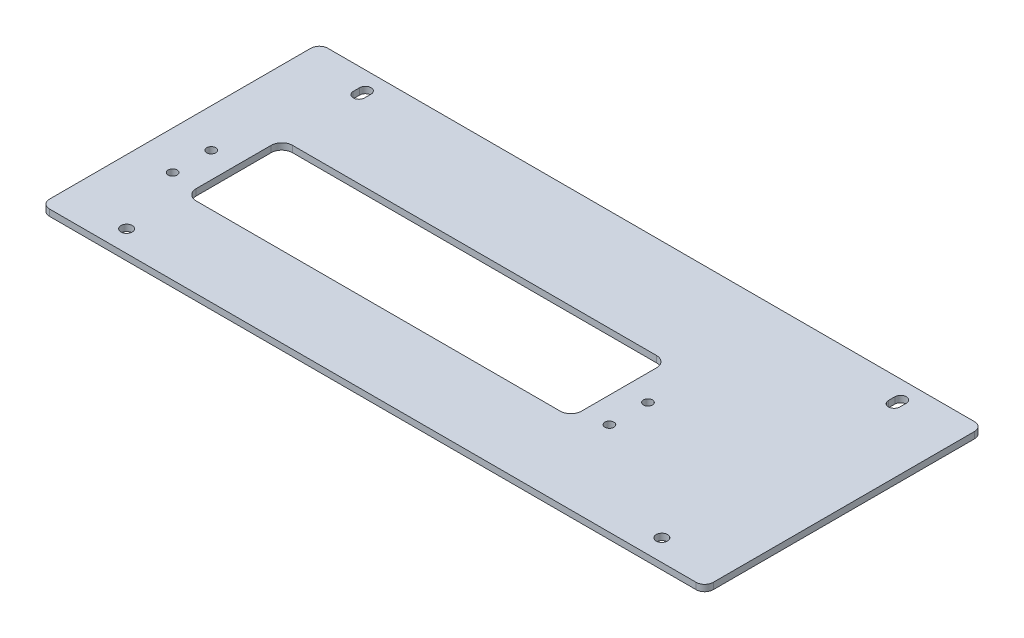
ISO-10303-21;
HEADER;
FILE_DESCRIPTION(('STEP AP214'),'2;1');
FILE_NAME('part.step','',(''),(''),'','','');
FILE_SCHEMA(('AUTOMOTIVE_DESIGN { 1 0 10303 214 1 1 1 1 }'));
ENDSEC;
DATA;
#1=APPLICATION_CONTEXT('core data for automotive mechanical design processes');
#2=APPLICATION_PROTOCOL_DEFINITION('international standard','automotive_design',2000,#1);
#3=PRODUCT_CONTEXT('',#1,'mechanical');
#4=PRODUCT('Part','Part','',(#3));
#5=PRODUCT_RELATED_PRODUCT_CATEGORY('part','',(#4));
#6=PRODUCT_DEFINITION_FORMATION('','',#4);
#7=PRODUCT_DEFINITION_CONTEXT('part definition',#1,'design');
#8=PRODUCT_DEFINITION('design','',#6,#7);
#9=PRODUCT_DEFINITION_SHAPE('','',#8);
#10=(LENGTH_UNIT() NAMED_UNIT(*) SI_UNIT(.MILLI.,.METRE.));
#11=(NAMED_UNIT(*) PLANE_ANGLE_UNIT() SI_UNIT($,.RADIAN.));
#12=(NAMED_UNIT(*) SI_UNIT($,.STERADIAN.) SOLID_ANGLE_UNIT());
#13=UNCERTAINTY_MEASURE_WITH_UNIT(LENGTH_MEASURE(1.E-05),#10,'distance_accuracy_value','');
#14=(GEOMETRIC_REPRESENTATION_CONTEXT(3) GLOBAL_UNCERTAINTY_ASSIGNED_CONTEXT((#13)) GLOBAL_UNIT_ASSIGNED_CONTEXT((#10,
#11,#12)) REPRESENTATION_CONTEXT('',''));
#15=CARTESIAN_POINT('',(0.,0.,0.));
#16=DIRECTION('',(0.,0.,1.));
#17=DIRECTION('',(1.,0.,0.));
#18=AXIS2_PLACEMENT_3D('',#15,#16,#17);
#19=CARTESIAN_POINT('',(0.,0.,0.));
#20=DIRECTION('',(0.,-1.,0.));
#21=DIRECTION('',(0.,0.,-1.));
#22=AXIS2_PLACEMENT_3D('',#19,#20,#21);
#23=PLANE('',#22);
#24=CARTESIAN_POINT('',(-125.,0.,-53.5));
#25=DIRECTION('',(0.,1.,0.));
#26=DIRECTION('',(0.,0.,1.));
#27=AXIS2_PLACEMENT_3D('',#24,#25,#26);
#28=CIRCLE('',#27,2.65000000000001);
#29=CARTESIAN_POINT('',(-127.65,0.,-53.5));
#30=VERTEX_POINT('',#29);
#31=CARTESIAN_POINT('',(-122.35,0.,-53.5));
#32=VERTEX_POINT('',#31);
#33=EDGE_CURVE('E216',#30,#32,#28,.T.);
#34=ORIENTED_EDGE('',*,*,#33,.T.);
#35=DIRECTION('',(0.,0.,-1.));
#36=VECTOR('',#35,1.);
#37=CARTESIAN_POINT('',(-122.35,0.,-53.5));
#38=LINE('',#37,#36);
#39=CARTESIAN_POINT('',(-122.35,0.,-56.5));
#40=VERTEX_POINT('',#39);
#41=EDGE_CURVE('E205',#32,#40,#38,.T.);
#42=ORIENTED_EDGE('',*,*,#41,.T.);
#43=CARTESIAN_POINT('',(-125.,0.,-56.5));
#44=DIRECTION('',(0.,1.,0.));
#45=DIRECTION('',(0.,0.,1.));
#46=AXIS2_PLACEMENT_3D('',#43,#44,#45);
#47=CIRCLE('',#46,2.65000000000001);
#48=CARTESIAN_POINT('',(-127.65,0.,-56.5));
#49=VERTEX_POINT('',#48);
#50=EDGE_CURVE('E215',#40,#49,#47,.T.);
#51=ORIENTED_EDGE('',*,*,#50,.T.);
#52=DIRECTION('',(0.,0.,1.));
#53=VECTOR('',#52,1.);
#54=CARTESIAN_POINT('',(-127.65,0.,-53.5));
#55=LINE('',#54,#53);
#56=EDGE_CURVE('E224',#49,#30,#55,.T.);
#57=ORIENTED_EDGE('',*,*,#56,.T.);
#58=EDGE_LOOP('',(#34,#42,#51,#57));
#59=FACE_BOUND('',#58,.T.);
#60=CARTESIAN_POINT('',(125.,0.,-53.5));
#61=DIRECTION('',(0.,1.,0.));
#62=DIRECTION('',(0.,0.,1.));
#63=AXIS2_PLACEMENT_3D('',#60,#61,#62);
#64=CIRCLE('',#63,2.65000000000001);
#65=CARTESIAN_POINT('',(122.35,0.,-53.5));
#66=VERTEX_POINT('',#65);
#67=CARTESIAN_POINT('',(127.65,0.,-53.5));
#68=VERTEX_POINT('',#67);
#69=EDGE_CURVE('E256',#66,#68,#64,.T.);
#70=ORIENTED_EDGE('',*,*,#69,.T.);
#71=DIRECTION('',(0.,0.,-1.));
#72=VECTOR('',#71,1.);
#73=CARTESIAN_POINT('',(127.65,0.,-53.5));
#74=LINE('',#73,#72);
#75=CARTESIAN_POINT('',(127.65,0.,-56.5));
#76=VERTEX_POINT('',#75);
#77=EDGE_CURVE('E259',#68,#76,#74,.T.);
#78=ORIENTED_EDGE('',*,*,#77,.T.);
#79=CARTESIAN_POINT('',(125.,0.,-56.5));
#80=DIRECTION('',(0.,1.,0.));
#81=DIRECTION('',(0.,0.,1.));
#82=AXIS2_PLACEMENT_3D('',#79,#80,#81);
#83=CIRCLE('',#82,2.65000000000001);
#84=CARTESIAN_POINT('',(122.35,0.,-56.5));
#85=VERTEX_POINT('',#84);
#86=EDGE_CURVE('E263',#76,#85,#83,.T.);
#87=ORIENTED_EDGE('',*,*,#86,.T.);
#88=DIRECTION('',(0.,0.,1.));
#89=VECTOR('',#88,1.);
#90=CARTESIAN_POINT('',(122.35,0.,-53.5));
#91=LINE('',#90,#89);
#92=EDGE_CURVE('E266',#85,#66,#91,.T.);
#93=ORIENTED_EDGE('',*,*,#92,.T.);
#94=EDGE_LOOP('',(#70,#78,#87,#93));
#95=FACE_BOUND('',#94,.T.);
#96=CARTESIAN_POINT('',(67.,0.,3.50000000000001));
#97=DIRECTION('',(0.,1.,0.));
#98=DIRECTION('',(0.,0.,1.));
#99=AXIS2_PLACEMENT_3D('',#96,#97,#98);
#100=CIRCLE('',#99,2.1);
#101=CARTESIAN_POINT('',(67.,0.,5.60000000000001));
#102=VERTEX_POINT('',#101);
#103=EDGE_CURVE('E300',#102,#102,#100,.T.);
#104=ORIENTED_EDGE('',*,*,#103,.T.);
#105=EDGE_LOOP('',(#104));
#106=FACE_BOUND('',#105,.T.);
#107=CARTESIAN_POINT('',(-137.,0.,21.5));
#108=DIRECTION('',(0.,1.,0.));
#109=DIRECTION('',(0.,0.,1.));
#110=AXIS2_PLACEMENT_3D('',#107,#108,#109);
#111=CIRCLE('',#110,2.09999999999999);
#112=CARTESIAN_POINT('',(-137.,0.,23.6));
#113=VERTEX_POINT('',#112);
#114=EDGE_CURVE('E312',#113,#113,#111,.T.);
#115=ORIENTED_EDGE('',*,*,#114,.T.);
#116=EDGE_LOOP('',(#115));
#117=FACE_BOUND('',#116,.T.);
#118=CARTESIAN_POINT('',(-137.,0.,3.50000000000003));
#119=DIRECTION('',(0.,1.,0.));
#120=DIRECTION('',(0.,0.,1.));
#121=AXIS2_PLACEMENT_3D('',#118,#119,#120);
#122=CIRCLE('',#121,2.09999999999999);
#123=CARTESIAN_POINT('',(-137.,0.,5.60000000000002));
#124=VERTEX_POINT('',#123);
#125=EDGE_CURVE('E319',#124,#124,#122,.T.);
#126=ORIENTED_EDGE('',*,*,#125,.T.);
#127=EDGE_LOOP('',(#126));
#128=FACE_BOUND('',#127,.T.);
#129=CARTESIAN_POINT('',(67.,0.,21.5));
#130=DIRECTION('',(0.,1.,0.));
#131=DIRECTION('',(0.,0.,1.));
#132=AXIS2_PLACEMENT_3D('',#129,#130,#131);
#133=CIRCLE('',#132,2.1);
#134=CARTESIAN_POINT('',(67.,0.,23.6));
#135=VERTEX_POINT('',#134);
#136=EDGE_CURVE('E327',#135,#135,#133,.T.);
#137=ORIENTED_EDGE('',*,*,#136,.T.);
#138=EDGE_LOOP('',(#137));
#139=FACE_BOUND('',#138,.T.);
#140=DIRECTION('',(1.,0.,0.));
#141=VECTOR('',#140,1.);
#142=CARTESIAN_POINT('',(-125.,0.,27.5));
#143=LINE('',#142,#141);
#144=CARTESIAN_POINT('',(-120.,0.,27.5));
#145=VERTEX_POINT('',#144);
#146=CARTESIAN_POINT('',(50.,0.,27.5));
#147=VERTEX_POINT('',#146);
#148=EDGE_CURVE('E617',#145,#147,#143,.T.);
#149=ORIENTED_EDGE('',*,*,#148,.T.);
#150=CARTESIAN_POINT('',(50.,0.,22.5));
#151=DIRECTION('',(0.,-1.,0.));
#152=DIRECTION('',(0.,0.,-1.));
#153=AXIS2_PLACEMENT_3D('',#150,#151,#152);
#154=CIRCLE('',#153,5.);
#155=CARTESIAN_POINT('',(55.,0.,22.5));
#156=VERTEX_POINT('',#155);
#157=EDGE_CURVE('E368',#147,#156,#154,.F.);
#158=ORIENTED_EDGE('',*,*,#157,.T.);
#159=DIRECTION('',(0.,0.,-1.));
#160=VECTOR('',#159,1.);
#161=CARTESIAN_POINT('',(55.,0.,27.5));
#162=LINE('',#161,#160);
#163=CARTESIAN_POINT('',(55.,0.,-12.5));
#164=VERTEX_POINT('',#163);
#165=EDGE_CURVE('E632',#156,#164,#162,.T.);
#166=ORIENTED_EDGE('',*,*,#165,.T.);
#167=CARTESIAN_POINT('',(50.,0.,-12.5));
#168=DIRECTION('',(0.,-1.,0.));
#169=DIRECTION('',(0.,0.,-1.));
#170=AXIS2_PLACEMENT_3D('',#167,#168,#169);
#171=CIRCLE('',#170,5.);
#172=CARTESIAN_POINT('',(50.,0.,-17.5));
#173=VERTEX_POINT('',#172);
#174=EDGE_CURVE('E358',#164,#173,#171,.F.);
#175=ORIENTED_EDGE('',*,*,#174,.T.);
#176=DIRECTION('',(-1.,0.,0.));
#177=VECTOR('',#176,1.);
#178=CARTESIAN_POINT('',(-125.,0.,-17.5));
#179=LINE('',#178,#177);
#180=CARTESIAN_POINT('',(-120.,0.,-17.5));
#181=VERTEX_POINT('',#180);
#182=EDGE_CURVE('E628',#173,#181,#179,.T.);
#183=ORIENTED_EDGE('',*,*,#182,.T.);
#184=CARTESIAN_POINT('',(-120.,0.,-12.5));
#185=DIRECTION('',(0.,-1.,0.));
#186=DIRECTION('',(0.,0.,-1.));
#187=AXIS2_PLACEMENT_3D('',#184,#185,#186);
#188=CIRCLE('',#187,5.);
#189=CARTESIAN_POINT('',(-125.,0.,-12.5));
#190=VERTEX_POINT('',#189);
#191=EDGE_CURVE('E12',#181,#190,#188,.F.);
#192=ORIENTED_EDGE('',*,*,#191,.T.);
#193=DIRECTION('',(0.,0.,1.));
#194=VECTOR('',#193,1.);
#195=CARTESIAN_POINT('',(-125.,0.,27.5));
#196=LINE('',#195,#194);
#197=CARTESIAN_POINT('',(-125.,0.,22.5));
#198=VERTEX_POINT('',#197);
#199=EDGE_CURVE('E623',#190,#198,#196,.T.);
#200=ORIENTED_EDGE('',*,*,#199,.T.);
#201=CARTESIAN_POINT('',(-120.,0.,22.5));
#202=DIRECTION('',(0.,-1.,0.));
#203=DIRECTION('',(0.,0.,-1.));
#204=AXIS2_PLACEMENT_3D('',#201,#202,#203);
#205=CIRCLE('',#204,5.);
#206=EDGE_CURVE('E363',#198,#145,#205,.F.);
#207=ORIENTED_EDGE('',*,*,#206,.T.);
#208=EDGE_LOOP('',(#149,#158,#166,#175,#183,#192,#200,#207));
#209=FACE_BOUND('',#208,.T.);
#210=DIRECTION('',(1.,0.,0.));
#211=VECTOR('',#210,1.);
#212=CARTESIAN_POINT('',(-155.,0.,65.));
#213=LINE('',#212,#211);
#214=CARTESIAN_POINT('',(-151.,0.,65.));
#215=VERTEX_POINT('',#214);
#216=CARTESIAN_POINT('',(151.,0.,65.));
#217=VERTEX_POINT('',#216);
#218=EDGE_CURVE('E436',#215,#217,#213,.T.);
#219=ORIENTED_EDGE('',*,*,#218,.F.);
#220=CARTESIAN_POINT('',(-151.,0.,61.));
#221=DIRECTION('',(0.,-1.,0.));
#222=DIRECTION('',(0.,0.,-1.));
#223=AXIS2_PLACEMENT_3D('',#220,#221,#222);
#224=CIRCLE('',#223,4.);
#225=CARTESIAN_POINT('',(-155.,0.,61.));
#226=VERTEX_POINT('',#225);
#227=EDGE_CURVE('E422',#215,#226,#224,.T.);
#228=ORIENTED_EDGE('',*,*,#227,.T.);
#229=DIRECTION('',(0.,0.,1.));
#230=VECTOR('',#229,1.);
#231=CARTESIAN_POINT('',(-155.,0.,65.));
#232=LINE('',#231,#230);
#233=CARTESIAN_POINT('',(-155.,0.,-61.));
#234=VERTEX_POINT('',#233);
#235=EDGE_CURVE('E440',#234,#226,#232,.T.);
#236=ORIENTED_EDGE('',*,*,#235,.F.);
#237=CARTESIAN_POINT('',(-151.,0.,-61.));
#238=DIRECTION('',(0.,-1.,0.));
#239=DIRECTION('',(0.,0.,-1.));
#240=AXIS2_PLACEMENT_3D('',#237,#238,#239);
#241=CIRCLE('',#240,4.);
#242=CARTESIAN_POINT('',(-151.,0.,-65.));
#243=VERTEX_POINT('',#242);
#244=EDGE_CURVE('E424',#234,#243,#241,.T.);
#245=ORIENTED_EDGE('',*,*,#244,.T.);
#246=DIRECTION('',(-1.,0.,0.));
#247=VECTOR('',#246,1.);
#248=CARTESIAN_POINT('',(-155.,0.,-65.));
#249=LINE('',#248,#247);
#250=CARTESIAN_POINT('',(151.,0.,-65.));
#251=VERTEX_POINT('',#250);
#252=EDGE_CURVE('E443',#251,#243,#249,.T.);
#253=ORIENTED_EDGE('',*,*,#252,.F.);
#254=CARTESIAN_POINT('',(151.,0.,-61.));
#255=DIRECTION('',(0.,-1.,0.));
#256=DIRECTION('',(0.,0.,-1.));
#257=AXIS2_PLACEMENT_3D('',#254,#255,#256);
#258=CIRCLE('',#257,4.);
#259=CARTESIAN_POINT('',(155.,0.,-61.));
#260=VERTEX_POINT('',#259);
#261=EDGE_CURVE('E426',#251,#260,#258,.T.);
#262=ORIENTED_EDGE('',*,*,#261,.T.);
#263=DIRECTION('',(0.,0.,-1.));
#264=VECTOR('',#263,1.);
#265=CARTESIAN_POINT('',(155.,0.,65.));
#266=LINE('',#265,#264);
#267=CARTESIAN_POINT('',(155.,0.,61.));
#268=VERTEX_POINT('',#267);
#269=EDGE_CURVE('E446',#268,#260,#266,.T.);
#270=ORIENTED_EDGE('',*,*,#269,.F.);
#271=CARTESIAN_POINT('',(151.,0.,61.));
#272=DIRECTION('',(0.,-1.,0.));
#273=DIRECTION('',(0.,0.,-1.));
#274=AXIS2_PLACEMENT_3D('',#271,#272,#273);
#275=CIRCLE('',#274,4.);
#276=EDGE_CURVE('E428',#268,#217,#275,.T.);
#277=ORIENTED_EDGE('',*,*,#276,.T.);
#278=EDGE_LOOP('',(#219,#228,#236,#245,#253,#262,#270,#277));
#279=FACE_BOUND('',#278,.T.);
#280=CARTESIAN_POINT('',(125.,0.,55.));
#281=DIRECTION('',(0.,1.,0.));
#282=DIRECTION('',(0.,0.,1.));
#283=AXIS2_PLACEMENT_3D('',#280,#281,#282);
#284=CIRCLE('',#283,2.64999999999999);
#285=CARTESIAN_POINT('',(125.,0.,57.65));
#286=VERTEX_POINT('',#285);
#287=EDGE_CURVE('E449',#286,#286,#284,.T.);
#288=ORIENTED_EDGE('',*,*,#287,.T.);
#289=EDGE_LOOP('',(#288));
#290=FACE_BOUND('',#289,.T.);
#291=CARTESIAN_POINT('',(-125.,0.,55.));
#292=DIRECTION('',(0.,1.,0.));
#293=DIRECTION('',(0.,0.,1.));
#294=AXIS2_PLACEMENT_3D('',#291,#292,#293);
#295=CIRCLE('',#294,2.65);
#296=CARTESIAN_POINT('',(-125.,0.,57.65));
#297=VERTEX_POINT('',#296);
#298=EDGE_CURVE('E607',#297,#297,#295,.T.);
#299=ORIENTED_EDGE('',*,*,#298,.T.);
#300=EDGE_LOOP('',(#299));
#301=FACE_BOUND('',#300,.T.);
#302=ADVANCED_FACE('F43',(#59,#95,#106,#117,#128,#139,#209,#279,#290,#301),#23,.T.);
#303=CARTESIAN_POINT('',(155.,3.,65.));
#304=DIRECTION('',(-1.,0.,0.));
#305=DIRECTION('',(0.,0.,1.));
#306=AXIS2_PLACEMENT_3D('',#303,#304,#305);
#307=PLANE('',#306);
#308=ORIENTED_EDGE('',*,*,#269,.T.);
#309=DIRECTION('',(0.,-1.,0.));
#310=VECTOR('',#309,1.);
#311=CARTESIAN_POINT('',(155.,3.,-61.));
#312=LINE('',#311,#310);
#313=CARTESIAN_POINT('',(155.,3.,-61.));
#314=VERTEX_POINT('',#313);
#315=EDGE_CURVE('E395',#260,#314,#312,.F.);
#316=ORIENTED_EDGE('',*,*,#315,.T.);
#317=DIRECTION('',(0.,0.,-1.));
#318=VECTOR('',#317,1.);
#319=CARTESIAN_POINT('',(155.,3.,65.));
#320=LINE('',#319,#318);
#321=CARTESIAN_POINT('',(155.,3.,61.));
#322=VERTEX_POINT('',#321);
#323=EDGE_CURVE('E439',#322,#314,#320,.T.);
#324=ORIENTED_EDGE('',*,*,#323,.F.);
#325=DIRECTION('',(0.,-1.,0.));
#326=VECTOR('',#325,1.);
#327=CARTESIAN_POINT('',(155.,3.,61.));
#328=LINE('',#327,#326);
#329=EDGE_CURVE('E397',#322,#268,#328,.T.);
#330=ORIENTED_EDGE('',*,*,#329,.T.);
#331=EDGE_LOOP('',(#308,#316,#324,#330));
#332=FACE_BOUND('',#331,.T.);
#333=ADVANCED_FACE('F498',(#332),#307,.F.);
#334=CARTESIAN_POINT('',(-155.,3.,-65.));
#335=DIRECTION('',(0.,0.,1.));
#336=DIRECTION('',(1.,0.,0.));
#337=AXIS2_PLACEMENT_3D('',#334,#335,#336);
#338=PLANE('',#337);
#339=ORIENTED_EDGE('',*,*,#252,.T.);
#340=DIRECTION('',(0.,-1.,0.));
#341=VECTOR('',#340,1.);
#342=CARTESIAN_POINT('',(-151.,3.,-65.));
#343=LINE('',#342,#341);
#344=CARTESIAN_POINT('',(-151.,3.,-65.));
#345=VERTEX_POINT('',#344);
#346=EDGE_CURVE('E400',#243,#345,#343,.F.);
#347=ORIENTED_EDGE('',*,*,#346,.T.);
#348=DIRECTION('',(-1.,0.,0.));
#349=VECTOR('',#348,1.);
#350=CARTESIAN_POINT('',(-155.,3.,-65.));
#351=LINE('',#350,#349);
#352=CARTESIAN_POINT('',(151.,3.,-65.));
#353=VERTEX_POINT('',#352);
#354=EDGE_CURVE('E463',#353,#345,#351,.T.);
#355=ORIENTED_EDGE('',*,*,#354,.F.);
#356=DIRECTION('',(0.,-1.,0.));
#357=VECTOR('',#356,1.);
#358=CARTESIAN_POINT('',(151.,3.,-65.));
#359=LINE('',#358,#357);
#360=EDGE_CURVE('E402',#353,#251,#359,.T.);
#361=ORIENTED_EDGE('',*,*,#360,.T.);
#362=EDGE_LOOP('',(#339,#347,#355,#361));
#363=FACE_BOUND('',#362,.T.);
#364=ADVANCED_FACE('F506',(#363),#338,.F.);
#365=CARTESIAN_POINT('',(-155.,3.,65.));
#366=DIRECTION('',(1.,0.,0.));
#367=DIRECTION('',(0.,0.,-1.));
#368=AXIS2_PLACEMENT_3D('',#365,#366,#367);
#369=PLANE('',#368);
#370=ORIENTED_EDGE('',*,*,#235,.T.);
#371=DIRECTION('',(0.,-1.,0.));
#372=VECTOR('',#371,1.);
#373=CARTESIAN_POINT('',(-155.,3.,61.));
#374=LINE('',#373,#372);
#375=CARTESIAN_POINT('',(-155.,3.,61.));
#376=VERTEX_POINT('',#375);
#377=EDGE_CURVE('E417',#226,#376,#374,.F.);
#378=ORIENTED_EDGE('',*,*,#377,.T.);
#379=DIRECTION('',(0.,0.,1.));
#380=VECTOR('',#379,1.);
#381=CARTESIAN_POINT('',(-155.,3.,65.));
#382=LINE('',#381,#380);
#383=CARTESIAN_POINT('',(-155.,3.,-61.));
#384=VERTEX_POINT('',#383);
#385=EDGE_CURVE('E454',#384,#376,#382,.T.);
#386=ORIENTED_EDGE('',*,*,#385,.F.);
#387=DIRECTION('',(0.,-1.,0.));
#388=VECTOR('',#387,1.);
#389=CARTESIAN_POINT('',(-155.,3.,-61.));
#390=LINE('',#389,#388);
#391=EDGE_CURVE('E419',#384,#234,#390,.T.);
#392=ORIENTED_EDGE('',*,*,#391,.T.);
#393=EDGE_LOOP('',(#370,#378,#386,#392));
#394=FACE_BOUND('',#393,.T.);
#395=ADVANCED_FACE('F510',(#394),#369,.F.);
#396=CARTESIAN_POINT('',(-155.,3.,65.));
#397=DIRECTION('',(0.,0.,-1.));
#398=DIRECTION('',(-1.,0.,0.));
#399=AXIS2_PLACEMENT_3D('',#396,#397,#398);
#400=PLANE('',#399);
#401=DIRECTION('',(1.,0.,0.));
#402=VECTOR('',#401,1.);
#403=CARTESIAN_POINT('',(-155.,3.,65.));
#404=LINE('',#403,#402);
#405=CARTESIAN_POINT('',(-151.,3.,65.));
#406=VERTEX_POINT('',#405);
#407=CARTESIAN_POINT('',(151.,3.,65.));
#408=VERTEX_POINT('',#407);
#409=EDGE_CURVE('E435',#406,#408,#404,.T.);
#410=ORIENTED_EDGE('',*,*,#409,.F.);
#411=DIRECTION('',(0.,-1.,0.));
#412=VECTOR('',#411,1.);
#413=CARTESIAN_POINT('',(-151.,3.,65.));
#414=LINE('',#413,#412);
#415=EDGE_CURVE('E430',#406,#215,#414,.T.);
#416=ORIENTED_EDGE('',*,*,#415,.T.);
#417=ORIENTED_EDGE('',*,*,#218,.T.);
#418=DIRECTION('',(0.,-1.,0.));
#419=VECTOR('',#418,1.);
#420=CARTESIAN_POINT('',(151.,3.,65.));
#421=LINE('',#420,#419);
#422=EDGE_CURVE('E433',#217,#408,#421,.F.);
#423=ORIENTED_EDGE('',*,*,#422,.T.);
#424=EDGE_LOOP('',(#410,#416,#417,#423));
#425=FACE_BOUND('',#424,.T.);
#426=ADVANCED_FACE('F486',(#425),#400,.F.);
#427=CARTESIAN_POINT('',(0.,3.,0.));
#428=DIRECTION('',(0.,-1.,0.));
#429=DIRECTION('',(0.,0.,-1.));
#430=AXIS2_PLACEMENT_3D('',#427,#428,#429);
#431=PLANE('',#430);
#432=CARTESIAN_POINT('',(67.,3.,3.50000000000001));
#433=DIRECTION('',(0.,1.,0.));
#434=DIRECTION('',(0.,0.,1.));
#435=AXIS2_PLACEMENT_3D('',#432,#433,#434);
#436=CIRCLE('',#435,2.1);
#437=CARTESIAN_POINT('',(67.,3.,5.60000000000001));
#438=VERTEX_POINT('',#437);
#439=EDGE_CURVE('E252',#438,#438,#436,.T.);
#440=ORIENTED_EDGE('',*,*,#439,.F.);
#441=EDGE_LOOP('',(#440));
#442=FACE_BOUND('',#441,.T.);
#443=CARTESIAN_POINT('',(-137.,3.,21.5));
#444=DIRECTION('',(0.,1.,0.));
#445=DIRECTION('',(0.,0.,1.));
#446=AXIS2_PLACEMENT_3D('',#443,#444,#445);
#447=CIRCLE('',#446,2.09999999999999);
#448=CARTESIAN_POINT('',(-137.,3.,23.6));
#449=VERTEX_POINT('',#448);
#450=EDGE_CURVE('E307',#449,#449,#447,.T.);
#451=ORIENTED_EDGE('',*,*,#450,.F.);
#452=EDGE_LOOP('',(#451));
#453=FACE_BOUND('',#452,.T.);
#454=CARTESIAN_POINT('',(-137.,3.,3.50000000000003));
#455=DIRECTION('',(0.,1.,0.));
#456=DIRECTION('',(0.,0.,1.));
#457=AXIS2_PLACEMENT_3D('',#454,#455,#456);
#458=CIRCLE('',#457,2.09999999999999);
#459=CARTESIAN_POINT('',(-137.,3.,5.60000000000002));
#460=VERTEX_POINT('',#459);
#461=EDGE_CURVE('E314',#460,#460,#458,.T.);
#462=ORIENTED_EDGE('',*,*,#461,.F.);
#463=EDGE_LOOP('',(#462));
#464=FACE_BOUND('',#463,.T.);
#465=CARTESIAN_POINT('',(67.,3.,21.5));
#466=DIRECTION('',(0.,1.,0.));
#467=DIRECTION('',(0.,0.,1.));
#468=AXIS2_PLACEMENT_3D('',#465,#466,#467);
#469=CIRCLE('',#468,2.1);
#470=CARTESIAN_POINT('',(67.,3.,23.6));
#471=VERTEX_POINT('',#470);
#472=EDGE_CURVE('E322',#471,#471,#469,.T.);
#473=ORIENTED_EDGE('',*,*,#472,.F.);
#474=EDGE_LOOP('',(#473));
#475=FACE_BOUND('',#474,.T.);
#476=DIRECTION('',(-1.,0.,0.));
#477=VECTOR('',#476,1.);
#478=CARTESIAN_POINT('',(-125.,3.,-17.5));
#479=LINE('',#478,#477);
#480=CARTESIAN_POINT('',(50.,3.,-17.5));
#481=VERTEX_POINT('',#480);
#482=CARTESIAN_POINT('',(-120.,3.,-17.5));
#483=VERTEX_POINT('',#482);
#484=EDGE_CURVE('E334',#481,#483,#479,.T.);
#485=ORIENTED_EDGE('',*,*,#484,.F.);
#486=CARTESIAN_POINT('',(50.,3.,-12.5));
#487=DIRECTION('',(0.,-1.,0.));
#488=DIRECTION('',(0.,0.,-1.));
#489=AXIS2_PLACEMENT_3D('',#486,#487,#488);
#490=CIRCLE('',#489,5.);
#491=CARTESIAN_POINT('',(55.,3.,-12.5));
#492=VERTEX_POINT('',#491);
#493=EDGE_CURVE('E359',#481,#492,#490,.T.);
#494=ORIENTED_EDGE('',*,*,#493,.T.);
#495=DIRECTION('',(0.,0.,-1.));
#496=VECTOR('',#495,1.);
#497=CARTESIAN_POINT('',(55.,3.,27.5));
#498=LINE('',#497,#496);
#499=CARTESIAN_POINT('',(55.,3.,22.5));
#500=VERTEX_POINT('',#499);
#501=EDGE_CURVE('E341',#500,#492,#498,.T.);
#502=ORIENTED_EDGE('',*,*,#501,.F.);
#503=CARTESIAN_POINT('',(50.,3.,22.5));
#504=DIRECTION('',(0.,-1.,0.));
#505=DIRECTION('',(0.,0.,-1.));
#506=AXIS2_PLACEMENT_3D('',#503,#504,#505);
#507=CIRCLE('',#506,5.);
#508=CARTESIAN_POINT('',(50.,3.,27.5));
#509=VERTEX_POINT('',#508);
#510=EDGE_CURVE('E370',#500,#509,#507,.T.);
#511=ORIENTED_EDGE('',*,*,#510,.T.);
#512=DIRECTION('',(1.,0.,0.));
#513=VECTOR('',#512,1.);
#514=CARTESIAN_POINT('',(-125.,3.,27.5));
#515=LINE('',#514,#513);
#516=CARTESIAN_POINT('',(-120.,3.,27.5));
#517=VERTEX_POINT('',#516);
#518=EDGE_CURVE('E348',#517,#509,#515,.T.);
#519=ORIENTED_EDGE('',*,*,#518,.F.);
#520=CARTESIAN_POINT('',(-120.,3.,22.5));
#521=DIRECTION('',(0.,-1.,0.));
#522=DIRECTION('',(0.,0.,-1.));
#523=AXIS2_PLACEMENT_3D('',#520,#521,#522);
#524=CIRCLE('',#523,5.);
#525=CARTESIAN_POINT('',(-125.,3.,22.5));
#526=VERTEX_POINT('',#525);
#527=EDGE_CURVE('E364',#517,#526,#524,.T.);
#528=ORIENTED_EDGE('',*,*,#527,.T.);
#529=DIRECTION('',(0.,0.,1.));
#530=VECTOR('',#529,1.);
#531=CARTESIAN_POINT('',(-125.,3.,27.5));
#532=LINE('',#531,#530);
#533=CARTESIAN_POINT('',(-125.,3.,-12.5));
#534=VERTEX_POINT('',#533);
#535=EDGE_CURVE('E340',#534,#526,#532,.T.);
#536=ORIENTED_EDGE('',*,*,#535,.F.);
#537=CARTESIAN_POINT('',(-120.,3.,-12.5));
#538=DIRECTION('',(0.,-1.,0.));
#539=DIRECTION('',(0.,0.,-1.));
#540=AXIS2_PLACEMENT_3D('',#537,#538,#539);
#541=CIRCLE('',#540,5.);
#542=EDGE_CURVE('E51',#534,#483,#541,.T.);
#543=ORIENTED_EDGE('',*,*,#542,.T.);
#544=EDGE_LOOP('',(#485,#494,#502,#511,#519,#528,#536,#543));
#545=FACE_BOUND('',#544,.T.);
#546=DIRECTION('',(0.,0.,-1.));
#547=VECTOR('',#546,1.);
#548=CARTESIAN_POINT('',(127.65,3.,-53.5));
#549=LINE('',#548,#547);
#550=CARTESIAN_POINT('',(127.65,3.,-53.5));
#551=VERTEX_POINT('',#550);
#552=CARTESIAN_POINT('',(127.65,3.,-56.5));
#553=VERTEX_POINT('',#552);
#554=EDGE_CURVE('E66',#551,#553,#549,.T.);
#555=ORIENTED_EDGE('',*,*,#554,.F.);
#556=CARTESIAN_POINT('',(125.,3.,-53.5));
#557=DIRECTION('',(0.,1.,0.));
#558=DIRECTION('',(0.,0.,1.));
#559=AXIS2_PLACEMENT_3D('',#556,#557,#558);
#560=CIRCLE('',#559,2.65000000000001);
#561=CARTESIAN_POINT('',(122.35,3.,-53.5));
#562=VERTEX_POINT('',#561);
#563=EDGE_CURVE('E270',#562,#551,#560,.T.);
#564=ORIENTED_EDGE('',*,*,#563,.F.);
#565=DIRECTION('',(0.,0.,1.));
#566=VECTOR('',#565,1.);
#567=CARTESIAN_POINT('',(122.35,3.,-53.5));
#568=LINE('',#567,#566);
#569=CARTESIAN_POINT('',(122.35,3.,-56.5));
#570=VERTEX_POINT('',#569);
#571=EDGE_CURVE('E260',#570,#562,#568,.T.);
#572=ORIENTED_EDGE('',*,*,#571,.F.);
#573=CARTESIAN_POINT('',(125.,3.,-56.5));
#574=DIRECTION('',(0.,1.,0.));
#575=DIRECTION('',(0.,0.,1.));
#576=AXIS2_PLACEMENT_3D('',#573,#574,#575);
#577=CIRCLE('',#576,2.65000000000001);
#578=EDGE_CURVE('E285',#553,#570,#577,.T.);
#579=ORIENTED_EDGE('',*,*,#578,.F.);
#580=EDGE_LOOP('',(#555,#564,#572,#579));
#581=FACE_BOUND('',#580,.T.);
#582=CARTESIAN_POINT('',(-125.,3.,55.));
#583=DIRECTION('',(0.,1.,0.));
#584=DIRECTION('',(0.,0.,1.));
#585=AXIS2_PLACEMENT_3D('',#582,#583,#584);
#586=CIRCLE('',#585,2.65);
#587=CARTESIAN_POINT('',(-125.,3.,57.65));
#588=VERTEX_POINT('',#587);
#589=EDGE_CURVE('E611',#588,#588,#586,.T.);
#590=ORIENTED_EDGE('',*,*,#589,.F.);
#591=EDGE_LOOP('',(#590));
#592=FACE_BOUND('',#591,.T.);
#593=DIRECTION('',(0.,0.,-1.));
#594=VECTOR('',#593,1.);
#595=CARTESIAN_POINT('',(-122.35,3.,-53.5));
#596=LINE('',#595,#594);
#597=CARTESIAN_POINT('',(-122.35,3.,-53.5));
#598=VERTEX_POINT('',#597);
#599=CARTESIAN_POINT('',(-122.35,3.,-56.5));
#600=VERTEX_POINT('',#599);
#601=EDGE_CURVE('E58',#598,#600,#596,.T.);
#602=ORIENTED_EDGE('',*,*,#601,.F.);
#603=CARTESIAN_POINT('',(-125.,3.,-53.5));
#604=DIRECTION('',(0.,1.,0.));
#605=DIRECTION('',(0.,0.,1.));
#606=AXIS2_PLACEMENT_3D('',#603,#604,#605);
#607=CIRCLE('',#606,2.65000000000001);
#608=CARTESIAN_POINT('',(-127.65,3.,-53.5));
#609=VERTEX_POINT('',#608);
#610=EDGE_CURVE('E223',#609,#598,#607,.T.);
#611=ORIENTED_EDGE('',*,*,#610,.F.);
#612=DIRECTION('',(0.,0.,1.));
#613=VECTOR('',#612,1.);
#614=CARTESIAN_POINT('',(-127.65,3.,-53.5));
#615=LINE('',#614,#613);
#616=CARTESIAN_POINT('',(-127.65,3.,-56.5));
#617=VERTEX_POINT('',#616);
#618=EDGE_CURVE('E227',#617,#609,#615,.T.);
#619=ORIENTED_EDGE('',*,*,#618,.F.);
#620=CARTESIAN_POINT('',(-125.,3.,-56.5));
#621=DIRECTION('',(0.,1.,0.));
#622=DIRECTION('',(0.,0.,1.));
#623=AXIS2_PLACEMENT_3D('',#620,#621,#622);
#624=CIRCLE('',#623,2.65000000000001);
#625=EDGE_CURVE('E230',#600,#617,#624,.T.);
#626=ORIENTED_EDGE('',*,*,#625,.F.);
#627=EDGE_LOOP('',(#602,#611,#619,#626));
#628=FACE_BOUND('',#627,.T.);
#629=CARTESIAN_POINT('',(125.,3.,55.));
#630=DIRECTION('',(0.,1.,0.));
#631=DIRECTION('',(0.,0.,1.));
#632=AXIS2_PLACEMENT_3D('',#629,#630,#631);
#633=CIRCLE('',#632,2.64999999999999);
#634=CARTESIAN_POINT('',(125.,3.,57.65));
#635=VERTEX_POINT('',#634);
#636=EDGE_CURVE('E605',#635,#635,#633,.T.);
#637=ORIENTED_EDGE('',*,*,#636,.F.);
#638=EDGE_LOOP('',(#637));
#639=FACE_BOUND('',#638,.T.);
#640=ORIENTED_EDGE('',*,*,#385,.T.);
#641=CARTESIAN_POINT('',(-151.,3.,61.));
#642=DIRECTION('',(0.,-1.,0.));
#643=DIRECTION('',(0.,0.,-1.));
#644=AXIS2_PLACEMENT_3D('',#641,#642,#643);
#645=CIRCLE('',#644,4.);
#646=EDGE_CURVE('E405',#376,#406,#645,.F.);
#647=ORIENTED_EDGE('',*,*,#646,.T.);
#648=ORIENTED_EDGE('',*,*,#409,.T.);
#649=CARTESIAN_POINT('',(151.,3.,61.));
#650=DIRECTION('',(0.,-1.,0.));
#651=DIRECTION('',(0.,0.,-1.));
#652=AXIS2_PLACEMENT_3D('',#649,#650,#651);
#653=CIRCLE('',#652,4.);
#654=EDGE_CURVE('E414',#408,#322,#653,.F.);
#655=ORIENTED_EDGE('',*,*,#654,.T.);
#656=ORIENTED_EDGE('',*,*,#323,.T.);
#657=CARTESIAN_POINT('',(151.,3.,-61.));
#658=DIRECTION('',(0.,-1.,0.));
#659=DIRECTION('',(0.,0.,-1.));
#660=AXIS2_PLACEMENT_3D('',#657,#658,#659);
#661=CIRCLE('',#660,4.);
#662=EDGE_CURVE('E411',#314,#353,#661,.F.);
#663=ORIENTED_EDGE('',*,*,#662,.T.);
#664=ORIENTED_EDGE('',*,*,#354,.T.);
#665=CARTESIAN_POINT('',(-151.,3.,-61.));
#666=DIRECTION('',(0.,-1.,0.));
#667=DIRECTION('',(0.,0.,-1.));
#668=AXIS2_PLACEMENT_3D('',#665,#666,#667);
#669=CIRCLE('',#668,4.);
#670=EDGE_CURVE('E408',#345,#384,#669,.F.);
#671=ORIENTED_EDGE('',*,*,#670,.T.);
#672=EDGE_LOOP('',(#640,#647,#648,#655,#656,#663,#664,#671));
#673=FACE_BOUND('',#672,.T.);
#674=ADVANCED_FACE('F476',(#442,#453,#464,#475,#545,#581,#592,#628,#639,#673),#431,.F.);
#675=CARTESIAN_POINT('',(-151.,3.,61.));
#676=DIRECTION('',(0.,-1.,0.));
#677=DIRECTION('',(0.,0.,-1.));
#678=AXIS2_PLACEMENT_3D('',#675,#676,#677);
#679=CYLINDRICAL_SURFACE('',#678,4.);
#680=ORIENTED_EDGE('',*,*,#646,.F.);
#681=ORIENTED_EDGE('',*,*,#377,.F.);
#682=ORIENTED_EDGE('',*,*,#227,.F.);
#683=ORIENTED_EDGE('',*,*,#415,.F.);
#684=EDGE_LOOP('',(#680,#681,#682,#683));
#685=FACE_BOUND('',#684,.T.);
#686=ADVANCED_FACE('F483',(#685),#679,.T.);
#687=CARTESIAN_POINT('',(-151.,3.,-61.));
#688=DIRECTION('',(0.,-1.,0.));
#689=DIRECTION('',(0.,0.,-1.));
#690=AXIS2_PLACEMENT_3D('',#687,#688,#689);
#691=CYLINDRICAL_SURFACE('',#690,4.);
#692=ORIENTED_EDGE('',*,*,#670,.F.);
#693=ORIENTED_EDGE('',*,*,#346,.F.);
#694=ORIENTED_EDGE('',*,*,#244,.F.);
#695=ORIENTED_EDGE('',*,*,#391,.F.);
#696=EDGE_LOOP('',(#692,#693,#694,#695));
#697=FACE_BOUND('',#696,.T.);
#698=ADVANCED_FACE('F509',(#697),#691,.T.);
#699=CARTESIAN_POINT('',(151.,3.,-61.));
#700=DIRECTION('',(0.,-1.,0.));
#701=DIRECTION('',(0.,0.,-1.));
#702=AXIS2_PLACEMENT_3D('',#699,#700,#701);
#703=CYLINDRICAL_SURFACE('',#702,4.);
#704=ORIENTED_EDGE('',*,*,#662,.F.);
#705=ORIENTED_EDGE('',*,*,#315,.F.);
#706=ORIENTED_EDGE('',*,*,#261,.F.);
#707=ORIENTED_EDGE('',*,*,#360,.F.);
#708=EDGE_LOOP('',(#704,#705,#706,#707));
#709=FACE_BOUND('',#708,.T.);
#710=ADVANCED_FACE('F503',(#709),#703,.T.);
#711=CARTESIAN_POINT('',(151.,3.,61.));
#712=DIRECTION('',(0.,-1.,0.));
#713=DIRECTION('',(0.,0.,-1.));
#714=AXIS2_PLACEMENT_3D('',#711,#712,#713);
#715=CYLINDRICAL_SURFACE('',#714,4.);
#716=ORIENTED_EDGE('',*,*,#654,.F.);
#717=ORIENTED_EDGE('',*,*,#422,.F.);
#718=ORIENTED_EDGE('',*,*,#276,.F.);
#719=ORIENTED_EDGE('',*,*,#329,.F.);
#720=EDGE_LOOP('',(#716,#717,#718,#719));
#721=FACE_BOUND('',#720,.T.);
#722=ADVANCED_FACE('F495',(#721),#715,.T.);
#723=CARTESIAN_POINT('',(125.,3.,55.));
#724=DIRECTION('',(0.,1.,0.));
#725=DIRECTION('',(0.,0.,1.));
#726=AXIS2_PLACEMENT_3D('',#723,#724,#725);
#727=CYLINDRICAL_SURFACE('',#726,2.64999999999999);
#728=ORIENTED_EDGE('',*,*,#287,.F.);
#729=EDGE_LOOP('',(#728));
#730=FACE_BOUND('',#729,.T.);
#731=ORIENTED_EDGE('',*,*,#636,.T.);
#732=EDGE_LOOP('',(#731));
#733=FACE_BOUND('',#732,.T.);
#734=ADVANCED_FACE('F529',(#730,#733),#727,.F.);
#735=CARTESIAN_POINT('',(-125.,3.,55.));
#736=DIRECTION('',(0.,1.,0.));
#737=DIRECTION('',(0.,0.,1.));
#738=AXIS2_PLACEMENT_3D('',#735,#736,#737);
#739=CYLINDRICAL_SURFACE('',#738,2.65);
#740=ORIENTED_EDGE('',*,*,#298,.F.);
#741=EDGE_LOOP('',(#740));
#742=FACE_BOUND('',#741,.T.);
#743=ORIENTED_EDGE('',*,*,#589,.T.);
#744=EDGE_LOOP('',(#743));
#745=FACE_BOUND('',#744,.T.);
#746=ADVANCED_FACE('F532',(#742,#745),#739,.F.);
#747=CARTESIAN_POINT('',(55.,0.,27.5));
#748=DIRECTION('',(1.,0.,0.));
#749=DIRECTION('',(0.,0.,-1.));
#750=AXIS2_PLACEMENT_3D('',#747,#748,#749);
#751=PLANE('',#750);
#752=ORIENTED_EDGE('',*,*,#165,.F.);
#753=DIRECTION('',(0.,1.,0.));
#754=VECTOR('',#753,1.);
#755=CARTESIAN_POINT('',(55.,3.,22.5));
#756=LINE('',#755,#754);
#757=EDGE_CURVE('E390',#156,#500,#756,.T.);
#758=ORIENTED_EDGE('',*,*,#757,.T.);
#759=ORIENTED_EDGE('',*,*,#501,.T.);
#760=DIRECTION('',(0.,1.,0.));
#761=VECTOR('',#760,1.);
#762=CARTESIAN_POINT('',(55.,0.,-12.5));
#763=LINE('',#762,#761);
#764=EDGE_CURVE('E393',#492,#164,#763,.F.);
#765=ORIENTED_EDGE('',*,*,#764,.T.);
#766=EDGE_LOOP('',(#752,#758,#759,#765));
#767=FACE_BOUND('',#766,.T.);
#768=ADVANCED_FACE('F536',(#767),#751,.F.);
#769=CARTESIAN_POINT('',(-125.,0.,27.5));
#770=DIRECTION('',(0.,0.,1.));
#771=DIRECTION('',(1.,0.,0.));
#772=AXIS2_PLACEMENT_3D('',#769,#770,#771);
#773=PLANE('',#772);
#774=ORIENTED_EDGE('',*,*,#518,.T.);
#775=DIRECTION('',(0.,1.,0.));
#776=VECTOR('',#775,1.);
#777=CARTESIAN_POINT('',(50.,0.,27.5));
#778=LINE('',#777,#776);
#779=EDGE_CURVE('E385',#509,#147,#778,.F.);
#780=ORIENTED_EDGE('',*,*,#779,.T.);
#781=ORIENTED_EDGE('',*,*,#148,.F.);
#782=DIRECTION('',(0.,1.,0.));
#783=VECTOR('',#782,1.);
#784=CARTESIAN_POINT('',(-120.,3.,27.5));
#785=LINE('',#784,#783);
#786=EDGE_CURVE('E387',#145,#517,#785,.T.);
#787=ORIENTED_EDGE('',*,*,#786,.T.);
#788=EDGE_LOOP('',(#774,#780,#781,#787));
#789=FACE_BOUND('',#788,.T.);
#790=ADVANCED_FACE('F540',(#789),#773,.F.);
#791=CARTESIAN_POINT('',(-125.,0.,27.5));
#792=DIRECTION('',(-1.,0.,0.));
#793=DIRECTION('',(0.,0.,1.));
#794=AXIS2_PLACEMENT_3D('',#791,#792,#793);
#795=PLANE('',#794);
#796=ORIENTED_EDGE('',*,*,#535,.T.);
#797=DIRECTION('',(0.,1.,0.));
#798=VECTOR('',#797,1.);
#799=CARTESIAN_POINT('',(-125.,0.,22.5));
#800=LINE('',#799,#798);
#801=EDGE_CURVE('E380',#526,#198,#800,.F.);
#802=ORIENTED_EDGE('',*,*,#801,.T.);
#803=ORIENTED_EDGE('',*,*,#199,.F.);
#804=DIRECTION('',(0.,1.,0.));
#805=VECTOR('',#804,1.);
#806=CARTESIAN_POINT('',(-125.,3.,-12.5));
#807=LINE('',#806,#805);
#808=EDGE_CURVE('E382',#190,#534,#807,.T.);
#809=ORIENTED_EDGE('',*,*,#808,.T.);
#810=EDGE_LOOP('',(#796,#802,#803,#809));
#811=FACE_BOUND('',#810,.T.);
#812=ADVANCED_FACE('F546',(#811),#795,.F.);
#813=CARTESIAN_POINT('',(-125.,0.,-17.5));
#814=DIRECTION('',(0.,0.,-1.));
#815=DIRECTION('',(-1.,0.,0.));
#816=AXIS2_PLACEMENT_3D('',#813,#814,#815);
#817=PLANE('',#816);
#818=ORIENTED_EDGE('',*,*,#182,.F.);
#819=DIRECTION('',(0.,1.,0.));
#820=VECTOR('',#819,1.);
#821=CARTESIAN_POINT('',(50.,3.,-17.5));
#822=LINE('',#821,#820);
#823=EDGE_CURVE('E374',#173,#481,#822,.T.);
#824=ORIENTED_EDGE('',*,*,#823,.T.);
#825=ORIENTED_EDGE('',*,*,#484,.T.);
#826=DIRECTION('',(0.,1.,0.));
#827=VECTOR('',#826,1.);
#828=CARTESIAN_POINT('',(-120.,0.,-17.5));
#829=LINE('',#828,#827);
#830=EDGE_CURVE('E378',#483,#181,#829,.F.);
#831=ORIENTED_EDGE('',*,*,#830,.T.);
#832=EDGE_LOOP('',(#818,#824,#825,#831));
#833=FACE_BOUND('',#832,.T.);
#834=ADVANCED_FACE('F542',(#833),#817,.F.);
#835=CARTESIAN_POINT('',(50.,0.,22.5));
#836=DIRECTION('',(0.,-1.,0.));
#837=DIRECTION('',(0.,0.,-1.));
#838=AXIS2_PLACEMENT_3D('',#835,#836,#837);
#839=CYLINDRICAL_SURFACE('',#838,5.);
#840=ORIENTED_EDGE('',*,*,#157,.F.);
#841=ORIENTED_EDGE('',*,*,#779,.F.);
#842=ORIENTED_EDGE('',*,*,#510,.F.);
#843=ORIENTED_EDGE('',*,*,#757,.F.);
#844=EDGE_LOOP('',(#840,#841,#842,#843));
#845=FACE_BOUND('',#844,.T.);
#846=ADVANCED_FACE('F545',(#845),#839,.F.);
#847=CARTESIAN_POINT('',(-120.,0.,22.5));
#848=DIRECTION('',(0.,-1.,0.));
#849=DIRECTION('',(0.,0.,-1.));
#850=AXIS2_PLACEMENT_3D('',#847,#848,#849);
#851=CYLINDRICAL_SURFACE('',#850,5.);
#852=ORIENTED_EDGE('',*,*,#206,.F.);
#853=ORIENTED_EDGE('',*,*,#801,.F.);
#854=ORIENTED_EDGE('',*,*,#527,.F.);
#855=ORIENTED_EDGE('',*,*,#786,.F.);
#856=EDGE_LOOP('',(#852,#853,#854,#855));
#857=FACE_BOUND('',#856,.T.);
#858=ADVANCED_FACE('F661',(#857),#851,.F.);
#859=CARTESIAN_POINT('',(50.,0.,-12.5));
#860=DIRECTION('',(0.,-1.,0.));
#861=DIRECTION('',(0.,0.,-1.));
#862=AXIS2_PLACEMENT_3D('',#859,#860,#861);
#863=CYLINDRICAL_SURFACE('',#862,5.);
#864=ORIENTED_EDGE('',*,*,#174,.F.);
#865=ORIENTED_EDGE('',*,*,#764,.F.);
#866=ORIENTED_EDGE('',*,*,#493,.F.);
#867=ORIENTED_EDGE('',*,*,#823,.F.);
#868=EDGE_LOOP('',(#864,#865,#866,#867));
#869=FACE_BOUND('',#868,.T.);
#870=ADVANCED_FACE('F648',(#869),#863,.F.);
#871=CARTESIAN_POINT('',(-120.,0.,-12.5));
#872=DIRECTION('',(0.,-1.,0.));
#873=DIRECTION('',(0.,0.,-1.));
#874=AXIS2_PLACEMENT_3D('',#871,#872,#873);
#875=CYLINDRICAL_SURFACE('',#874,5.);
#876=ORIENTED_EDGE('',*,*,#191,.F.);
#877=ORIENTED_EDGE('',*,*,#830,.F.);
#878=ORIENTED_EDGE('',*,*,#542,.F.);
#879=ORIENTED_EDGE('',*,*,#808,.F.);
#880=EDGE_LOOP('',(#876,#877,#878,#879));
#881=FACE_BOUND('',#880,.T.);
#882=ADVANCED_FACE('F45',(#881),#875,.F.);
#883=CARTESIAN_POINT('',(67.,3.,21.5));
#884=DIRECTION('',(0.,1.,0.));
#885=DIRECTION('',(0.,0.,1.));
#886=AXIS2_PLACEMENT_3D('',#883,#884,#885);
#887=CYLINDRICAL_SURFACE('',#886,2.1);
#888=ORIENTED_EDGE('',*,*,#136,.F.);
#889=EDGE_LOOP('',(#888));
#890=FACE_BOUND('',#889,.T.);
#891=ORIENTED_EDGE('',*,*,#472,.T.);
#892=EDGE_LOOP('',(#891));
#893=FACE_BOUND('',#892,.T.);
#894=ADVANCED_FACE('F554',(#890,#893),#887,.F.);
#895=CARTESIAN_POINT('',(-137.,3.,3.50000000000003));
#896=DIRECTION('',(0.,1.,0.));
#897=DIRECTION('',(0.,0.,1.));
#898=AXIS2_PLACEMENT_3D('',#895,#896,#897);
#899=CYLINDRICAL_SURFACE('',#898,2.09999999999999);
#900=ORIENTED_EDGE('',*,*,#125,.F.);
#901=EDGE_LOOP('',(#900));
#902=FACE_BOUND('',#901,.T.);
#903=ORIENTED_EDGE('',*,*,#461,.T.);
#904=EDGE_LOOP('',(#903));
#905=FACE_BOUND('',#904,.T.);
#906=ADVANCED_FACE('F557',(#902,#905),#899,.F.);
#907=CARTESIAN_POINT('',(-137.,3.,21.5));
#908=DIRECTION('',(0.,1.,0.));
#909=DIRECTION('',(0.,0.,1.));
#910=AXIS2_PLACEMENT_3D('',#907,#908,#909);
#911=CYLINDRICAL_SURFACE('',#910,2.09999999999999);
#912=ORIENTED_EDGE('',*,*,#114,.F.);
#913=EDGE_LOOP('',(#912));
#914=FACE_BOUND('',#913,.T.);
#915=ORIENTED_EDGE('',*,*,#450,.T.);
#916=EDGE_LOOP('',(#915));
#917=FACE_BOUND('',#916,.T.);
#918=ADVANCED_FACE('F561',(#914,#917),#911,.F.);
#919=CARTESIAN_POINT('',(67.,3.,3.50000000000001));
#920=DIRECTION('',(0.,1.,0.));
#921=DIRECTION('',(0.,0.,1.));
#922=AXIS2_PLACEMENT_3D('',#919,#920,#921);
#923=CYLINDRICAL_SURFACE('',#922,2.1);
#924=ORIENTED_EDGE('',*,*,#103,.F.);
#925=EDGE_LOOP('',(#924));
#926=FACE_BOUND('',#925,.T.);
#927=ORIENTED_EDGE('',*,*,#439,.T.);
#928=EDGE_LOOP('',(#927));
#929=FACE_BOUND('',#928,.T.);
#930=ADVANCED_FACE('F565',(#926,#929),#923,.F.);
#931=CARTESIAN_POINT('',(122.35,0.,-53.5));
#932=DIRECTION('',(-1.,0.,0.));
#933=DIRECTION('',(0.,0.,1.));
#934=AXIS2_PLACEMENT_3D('',#931,#932,#933);
#935=PLANE('',#934);
#936=ORIENTED_EDGE('',*,*,#571,.T.);
#937=DIRECTION('',(0.,1.,0.));
#938=VECTOR('',#937,1.);
#939=CARTESIAN_POINT('',(122.35,0.,-53.5));
#940=LINE('',#939,#938);
#941=EDGE_CURVE('E238',#66,#562,#940,.T.);
#942=ORIENTED_EDGE('',*,*,#941,.F.);
#943=ORIENTED_EDGE('',*,*,#92,.F.);
#944=DIRECTION('',(0.,1.,0.));
#945=VECTOR('',#944,1.);
#946=CARTESIAN_POINT('',(122.35,0.,-56.5));
#947=LINE('',#946,#945);
#948=EDGE_CURVE('E289',#85,#570,#947,.T.);
#949=ORIENTED_EDGE('',*,*,#948,.T.);
#950=EDGE_LOOP('',(#936,#942,#943,#949));
#951=FACE_BOUND('',#950,.T.);
#952=ADVANCED_FACE('F569',(#951),#935,.F.);
#953=CARTESIAN_POINT('',(127.65,0.,-53.5));
#954=DIRECTION('',(1.,0.,0.));
#955=DIRECTION('',(0.,0.,-1.));
#956=AXIS2_PLACEMENT_3D('',#953,#954,#955);
#957=PLANE('',#956);
#958=ORIENTED_EDGE('',*,*,#554,.T.);
#959=DIRECTION('',(0.,1.,0.));
#960=VECTOR('',#959,1.);
#961=CARTESIAN_POINT('',(127.65,0.,-56.5));
#962=LINE('',#961,#960);
#963=EDGE_CURVE('E291',#76,#553,#962,.T.);
#964=ORIENTED_EDGE('',*,*,#963,.F.);
#965=ORIENTED_EDGE('',*,*,#77,.F.);
#966=DIRECTION('',(0.,1.,0.));
#967=VECTOR('',#966,1.);
#968=CARTESIAN_POINT('',(127.65,0.,-53.5));
#969=LINE('',#968,#967);
#970=EDGE_CURVE('E269',#68,#551,#969,.T.);
#971=ORIENTED_EDGE('',*,*,#970,.T.);
#972=EDGE_LOOP('',(#958,#964,#965,#971));
#973=FACE_BOUND('',#972,.T.);
#974=ADVANCED_FACE('F575',(#973),#957,.F.);
#975=CARTESIAN_POINT('',(125.,0.,-53.5));
#976=DIRECTION('',(0.,1.,0.));
#977=DIRECTION('',(0.,0.,1.));
#978=AXIS2_PLACEMENT_3D('',#975,#976,#977);
#979=CYLINDRICAL_SURFACE('',#978,2.65000000000001);
#980=ORIENTED_EDGE('',*,*,#563,.T.);
#981=ORIENTED_EDGE('',*,*,#970,.F.);
#982=ORIENTED_EDGE('',*,*,#69,.F.);
#983=ORIENTED_EDGE('',*,*,#941,.T.);
#984=EDGE_LOOP('',(#980,#981,#982,#983));
#985=FACE_BOUND('',#984,.T.);
#986=ADVANCED_FACE('F571',(#985),#979,.F.);
#987=CARTESIAN_POINT('',(125.,0.,-56.5));
#988=DIRECTION('',(0.,1.,0.));
#989=DIRECTION('',(0.,0.,1.));
#990=AXIS2_PLACEMENT_3D('',#987,#988,#989);
#991=CYLINDRICAL_SURFACE('',#990,2.65000000000001);
#992=ORIENTED_EDGE('',*,*,#578,.T.);
#993=ORIENTED_EDGE('',*,*,#948,.F.);
#994=ORIENTED_EDGE('',*,*,#86,.F.);
#995=ORIENTED_EDGE('',*,*,#963,.T.);
#996=EDGE_LOOP('',(#992,#993,#994,#995));
#997=FACE_BOUND('',#996,.T.);
#998=ADVANCED_FACE('F574',(#997),#991,.F.);
#999=CARTESIAN_POINT('',(-127.65,0.,-53.5));
#1000=DIRECTION('',(-1.,0.,0.));
#1001=DIRECTION('',(0.,0.,1.));
#1002=AXIS2_PLACEMENT_3D('',#999,#1000,#1001);
#1003=PLANE('',#1002);
#1004=ORIENTED_EDGE('',*,*,#618,.T.);
#1005=DIRECTION('',(0.,1.,0.));
#1006=VECTOR('',#1005,1.);
#1007=CARTESIAN_POINT('',(-127.65,0.,-53.5));
#1008=LINE('',#1007,#1006);
#1009=EDGE_CURVE('E250',#30,#609,#1008,.T.);
#1010=ORIENTED_EDGE('',*,*,#1009,.F.);
#1011=ORIENTED_EDGE('',*,*,#56,.F.);
#1012=DIRECTION('',(0.,1.,0.));
#1013=VECTOR('',#1012,1.);
#1014=CARTESIAN_POINT('',(-127.65,0.,-56.5));
#1015=LINE('',#1014,#1013);
#1016=EDGE_CURVE('E253',#49,#617,#1015,.T.);
#1017=ORIENTED_EDGE('',*,*,#1016,.T.);
#1018=EDGE_LOOP('',(#1004,#1010,#1011,#1017));
#1019=FACE_BOUND('',#1018,.T.);
#1020=ADVANCED_FACE('F582',(#1019),#1003,.F.);
#1021=CARTESIAN_POINT('',(-122.35,0.,-53.5));
#1022=DIRECTION('',(1.,0.,0.));
#1023=DIRECTION('',(0.,0.,-1.));
#1024=AXIS2_PLACEMENT_3D('',#1021,#1022,#1023);
#1025=PLANE('',#1024);
#1026=ORIENTED_EDGE('',*,*,#601,.T.);
#1027=DIRECTION('',(0.,1.,0.));
#1028=VECTOR('',#1027,1.);
#1029=CARTESIAN_POINT('',(-122.35,0.,-56.5));
#1030=LINE('',#1029,#1028);
#1031=EDGE_CURVE('E210',#40,#600,#1030,.T.);
#1032=ORIENTED_EDGE('',*,*,#1031,.F.);
#1033=ORIENTED_EDGE('',*,*,#41,.F.);
#1034=DIRECTION('',(0.,1.,0.));
#1035=VECTOR('',#1034,1.);
#1036=CARTESIAN_POINT('',(-122.35,0.,-53.5));
#1037=LINE('',#1036,#1035);
#1038=EDGE_CURVE('E208',#32,#598,#1037,.T.);
#1039=ORIENTED_EDGE('',*,*,#1038,.T.);
#1040=EDGE_LOOP('',(#1026,#1032,#1033,#1039));
#1041=FACE_BOUND('',#1040,.T.);
#1042=ADVANCED_FACE('F207',(#1041),#1025,.F.);
#1043=CARTESIAN_POINT('',(-125.,0.,-53.5));
#1044=DIRECTION('',(0.,1.,0.));
#1045=DIRECTION('',(0.,0.,1.));
#1046=AXIS2_PLACEMENT_3D('',#1043,#1044,#1045);
#1047=CYLINDRICAL_SURFACE('',#1046,2.65000000000001);
#1048=ORIENTED_EDGE('',*,*,#610,.T.);
#1049=ORIENTED_EDGE('',*,*,#1038,.F.);
#1050=ORIENTED_EDGE('',*,*,#33,.F.);
#1051=ORIENTED_EDGE('',*,*,#1009,.T.);
#1052=EDGE_LOOP('',(#1048,#1049,#1050,#1051));
#1053=FACE_BOUND('',#1052,.T.);
#1054=ADVANCED_FACE('F220',(#1053),#1047,.F.);
#1055=CARTESIAN_POINT('',(-125.,0.,-56.5));
#1056=DIRECTION('',(0.,1.,0.));
#1057=DIRECTION('',(0.,0.,1.));
#1058=AXIS2_PLACEMENT_3D('',#1055,#1056,#1057);
#1059=CYLINDRICAL_SURFACE('',#1058,2.65000000000001);
#1060=ORIENTED_EDGE('',*,*,#625,.T.);
#1061=ORIENTED_EDGE('',*,*,#1016,.F.);
#1062=ORIENTED_EDGE('',*,*,#50,.F.);
#1063=ORIENTED_EDGE('',*,*,#1031,.T.);
#1064=EDGE_LOOP('',(#1060,#1061,#1062,#1063));
#1065=FACE_BOUND('',#1064,.T.);
#1066=ADVANCED_FACE('F589',(#1065),#1059,.F.);
#1067=CLOSED_SHELL('',(#302,#333,#364,#395,#426,#674,#686,#698,#710,#722,#734,#746,#768,#790,
#812,#834,#846,#858,#870,#882,#894,#906,#918,#930,#952,#974,#986,#998,#1020,#1042,#1054,#1066));
#1068=MANIFOLD_SOLID_BREP('B2',#1067);
#1069=ADVANCED_BREP_SHAPE_REPRESENTATION('',(#18,#1068),#14);
#1070=SHAPE_DEFINITION_REPRESENTATION(#9,#1069);
ENDSEC;
END-ISO-10303-21;
